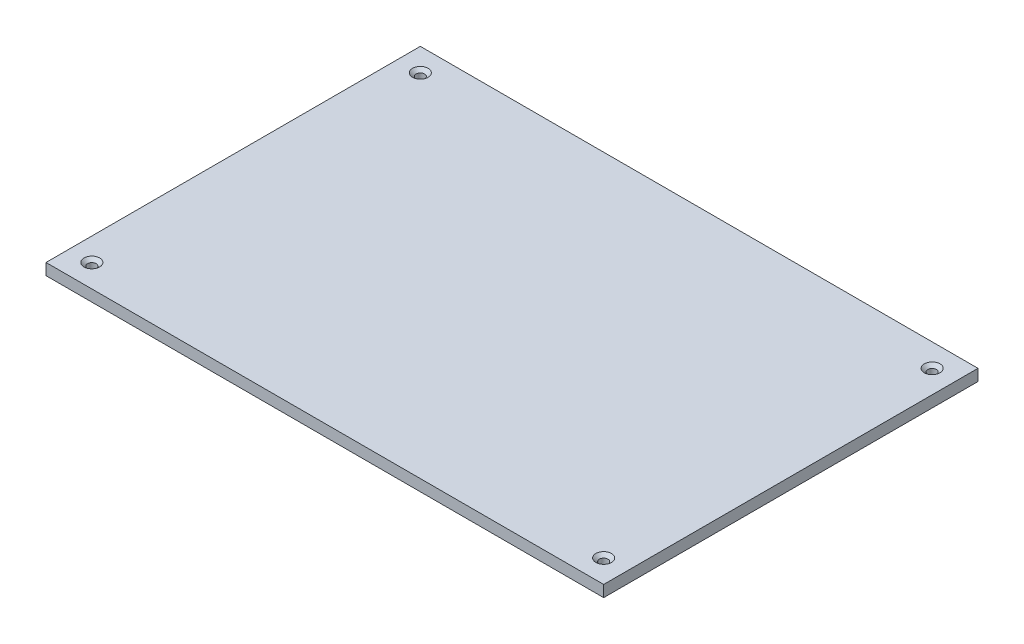
ISO-10303-21;
HEADER;
FILE_DESCRIPTION(('STEP AP214'),'2;1');
FILE_NAME('part.step','',(''),(''),'','','');
FILE_SCHEMA(('AUTOMOTIVE_DESIGN { 1 0 10303 214 1 1 1 1 }'));
ENDSEC;
DATA;
#1=APPLICATION_CONTEXT('core data for automotive mechanical design processes');
#2=APPLICATION_PROTOCOL_DEFINITION('international standard','automotive_design',2000,#1);
#3=PRODUCT_CONTEXT('',#1,'mechanical');
#4=PRODUCT('Part','Part','',(#3));
#5=PRODUCT_RELATED_PRODUCT_CATEGORY('part','',(#4));
#6=PRODUCT_DEFINITION_FORMATION('','',#4);
#7=PRODUCT_DEFINITION_CONTEXT('part definition',#1,'design');
#8=PRODUCT_DEFINITION('design','',#6,#7);
#9=PRODUCT_DEFINITION_SHAPE('','',#8);
#10=(LENGTH_UNIT() NAMED_UNIT(*) SI_UNIT(.MILLI.,.METRE.));
#11=(NAMED_UNIT(*) PLANE_ANGLE_UNIT() SI_UNIT($,.RADIAN.));
#12=(NAMED_UNIT(*) SI_UNIT($,.STERADIAN.) SOLID_ANGLE_UNIT());
#13=UNCERTAINTY_MEASURE_WITH_UNIT(LENGTH_MEASURE(1.E-05),#10,'distance_accuracy_value','');
#14=(GEOMETRIC_REPRESENTATION_CONTEXT(3) GLOBAL_UNCERTAINTY_ASSIGNED_CONTEXT((#13)) GLOBAL_UNIT_ASSIGNED_CONTEXT((#10,
#11,#12)) REPRESENTATION_CONTEXT('',''));
#15=CARTESIAN_POINT('',(0.,0.,0.));
#16=DIRECTION('',(0.,0.,1.));
#17=DIRECTION('',(1.,0.,0.));
#18=AXIS2_PLACEMENT_3D('',#15,#16,#17);
#19=CARTESIAN_POINT('',(0.,9.52500000000001,0.));
#20=DIRECTION('',(1.,0.,0.));
#21=DIRECTION('',(0.,0.,-1.));
#22=AXIS2_PLACEMENT_3D('',#19,#20,#21);
#23=PLANE('',#22);
#24=DIRECTION('',(0.,0.,1.));
#25=VECTOR('',#24,1.);
#26=CARTESIAN_POINT('',(0.,0.,0.));
#27=LINE('',#26,#25);
#28=CARTESIAN_POINT('',(0.,0.,0.));
#29=VERTEX_POINT('',#28);
#30=CARTESIAN_POINT('',(0.,0.,311.15));
#31=VERTEX_POINT('',#30);
#32=EDGE_CURVE('E142',#29,#31,#27,.T.);
#33=ORIENTED_EDGE('',*,*,#32,.T.);
#34=DIRECTION('',(0.,-1.,0.));
#35=VECTOR('',#34,1.);
#36=CARTESIAN_POINT('',(0.,9.52500000000001,311.15));
#37=LINE('',#36,#35);
#38=CARTESIAN_POINT('',(0.,9.52500000000001,311.15));
#39=VERTEX_POINT('',#38);
#40=EDGE_CURVE('E133',#39,#31,#37,.T.);
#41=ORIENTED_EDGE('',*,*,#40,.F.);
#42=DIRECTION('',(0.,0.,1.));
#43=VECTOR('',#42,1.);
#44=CARTESIAN_POINT('',(0.,9.52500000000001,0.));
#45=LINE('',#44,#43);
#46=CARTESIAN_POINT('',(0.,9.52500000000001,0.));
#47=VERTEX_POINT('',#46);
#48=EDGE_CURVE('E127',#47,#39,#45,.T.);
#49=ORIENTED_EDGE('',*,*,#48,.F.);
#50=DIRECTION('',(0.,-1.,0.));
#51=VECTOR('',#50,1.);
#52=CARTESIAN_POINT('',(0.,9.52500000000001,0.));
#53=LINE('',#52,#51);
#54=EDGE_CURVE('E138',#47,#29,#53,.T.);
#55=ORIENTED_EDGE('',*,*,#54,.T.);
#56=EDGE_LOOP('',(#33,#41,#49,#55));
#57=FACE_BOUND('',#56,.T.);
#58=ADVANCED_FACE('F74',(#57),#23,.F.);
#59=CARTESIAN_POINT('',(0.,9.52500000000001,311.15));
#60=DIRECTION('',(0.,0.,-1.));
#61=DIRECTION('',(-1.,0.,0.));
#62=AXIS2_PLACEMENT_3D('',#59,#60,#61);
#63=PLANE('',#62);
#64=DIRECTION('',(1.,0.,0.));
#65=VECTOR('',#64,1.);
#66=CARTESIAN_POINT('',(0.,0.,311.15));
#67=LINE('',#66,#65);
#68=CARTESIAN_POINT('',(463.55,0.,311.15));
#69=VERTEX_POINT('',#68);
#70=EDGE_CURVE('E132',#31,#69,#67,.T.);
#71=ORIENTED_EDGE('',*,*,#70,.T.);
#72=DIRECTION('',(0.,-1.,0.));
#73=VECTOR('',#72,1.);
#74=CARTESIAN_POINT('',(463.55,9.52500000000001,311.15));
#75=LINE('',#74,#73);
#76=CARTESIAN_POINT('',(463.55,9.52500000000001,311.15));
#77=VERTEX_POINT('',#76);
#78=EDGE_CURVE('E130',#77,#69,#75,.T.);
#79=ORIENTED_EDGE('',*,*,#78,.F.);
#80=DIRECTION('',(1.,0.,0.));
#81=VECTOR('',#80,1.);
#82=CARTESIAN_POINT('',(0.,9.52500000000001,311.15));
#83=LINE('',#82,#81);
#84=EDGE_CURVE('E122',#39,#77,#83,.T.);
#85=ORIENTED_EDGE('',*,*,#84,.F.);
#86=ORIENTED_EDGE('',*,*,#40,.T.);
#87=EDGE_LOOP('',(#71,#79,#85,#86));
#88=FACE_BOUND('',#87,.T.);
#89=ADVANCED_FACE('F131',(#88),#63,.F.);
#90=CARTESIAN_POINT('',(463.55,9.52500000000001,0.));
#91=DIRECTION('',(-1.,0.,0.));
#92=DIRECTION('',(0.,0.,1.));
#93=AXIS2_PLACEMENT_3D('',#90,#91,#92);
#94=PLANE('',#93);
#95=DIRECTION('',(0.,0.,-1.));
#96=VECTOR('',#95,1.);
#97=CARTESIAN_POINT('',(463.55,0.,0.));
#98=LINE('',#97,#96);
#99=CARTESIAN_POINT('',(463.55,0.,0.));
#100=VERTEX_POINT('',#99);
#101=EDGE_CURVE('E108',#69,#100,#98,.T.);
#102=ORIENTED_EDGE('',*,*,#101,.T.);
#103=DIRECTION('',(0.,-1.,0.));
#104=VECTOR('',#103,1.);
#105=CARTESIAN_POINT('',(463.55,9.52500000000001,0.));
#106=LINE('',#105,#104);
#107=CARTESIAN_POINT('',(463.55,9.52500000000001,0.));
#108=VERTEX_POINT('',#107);
#109=EDGE_CURVE('E134',#108,#100,#106,.T.);
#110=ORIENTED_EDGE('',*,*,#109,.F.);
#111=DIRECTION('',(0.,0.,-1.));
#112=VECTOR('',#111,1.);
#113=CARTESIAN_POINT('',(463.55,9.52500000000001,0.));
#114=LINE('',#113,#112);
#115=EDGE_CURVE('E125',#77,#108,#114,.T.);
#116=ORIENTED_EDGE('',*,*,#115,.F.);
#117=ORIENTED_EDGE('',*,*,#78,.T.);
#118=EDGE_LOOP('',(#102,#110,#116,#117));
#119=FACE_BOUND('',#118,.T.);
#120=ADVANCED_FACE('F136',(#119),#94,.F.);
#121=CARTESIAN_POINT('',(0.,9.52500000000001,0.));
#122=DIRECTION('',(0.,0.,1.));
#123=DIRECTION('',(1.,0.,0.));
#124=AXIS2_PLACEMENT_3D('',#121,#122,#123);
#125=PLANE('',#124);
#126=DIRECTION('',(-1.,0.,0.));
#127=VECTOR('',#126,1.);
#128=CARTESIAN_POINT('',(0.,0.,0.));
#129=LINE('',#128,#127);
#130=EDGE_CURVE('E114',#100,#29,#129,.T.);
#131=ORIENTED_EDGE('',*,*,#130,.T.);
#132=ORIENTED_EDGE('',*,*,#54,.F.);
#133=DIRECTION('',(-1.,0.,0.));
#134=VECTOR('',#133,1.);
#135=CARTESIAN_POINT('',(0.,9.52500000000001,0.));
#136=LINE('',#135,#134);
#137=EDGE_CURVE('E91',#108,#47,#136,.T.);
#138=ORIENTED_EDGE('',*,*,#137,.F.);
#139=ORIENTED_EDGE('',*,*,#109,.T.);
#140=EDGE_LOOP('',(#131,#132,#138,#139));
#141=FACE_BOUND('',#140,.T.);
#142=ADVANCED_FACE('F235',(#141),#125,.F.);
#143=CARTESIAN_POINT('',(0.,9.52500000000001,0.));
#144=DIRECTION('',(0.,1.,0.));
#145=DIRECTION('',(0.,0.,1.));
#146=AXIS2_PLACEMENT_3D('',#143,#144,#145);
#147=PLANE('',#146);
#148=CARTESIAN_POINT('',(444.5,9.52500000000001,292.1));
#149=DIRECTION('',(0.,1.,0.));
#150=DIRECTION('',(0.,0.,1.));
#151=AXIS2_PLACEMENT_3D('',#148,#149,#150);
#152=CIRCLE('',#151,6.49287500000018);
#153=CARTESIAN_POINT('',(444.5,9.52500000000001,298.592875));
#154=VERTEX_POINT('',#153);
#155=EDGE_CURVE('E164',#154,#154,#152,.F.);
#156=ORIENTED_EDGE('',*,*,#155,.T.);
#157=EDGE_LOOP('',(#156));
#158=FACE_BOUND('',#157,.T.);
#159=CARTESIAN_POINT('',(444.5,9.52500000000001,19.0499999999999));
#160=DIRECTION('',(0.,1.,0.));
#161=DIRECTION('',(0.,0.,1.));
#162=AXIS2_PLACEMENT_3D('',#159,#160,#161);
#163=CIRCLE('',#162,6.49287499999984);
#164=CARTESIAN_POINT('',(444.5,9.52500000000001,25.5428749999997));
#165=VERTEX_POINT('',#164);
#166=EDGE_CURVE('E161',#165,#165,#163,.F.);
#167=ORIENTED_EDGE('',*,*,#166,.T.);
#168=EDGE_LOOP('',(#167));
#169=FACE_BOUND('',#168,.T.);
#170=CARTESIAN_POINT('',(19.05,9.52500000000001,19.05));
#171=DIRECTION('',(0.,1.,0.));
#172=DIRECTION('',(0.,0.,1.));
#173=AXIS2_PLACEMENT_3D('',#170,#171,#172);
#174=CIRCLE('',#173,6.49287500000001);
#175=CARTESIAN_POINT('',(19.05,9.52500000000001,25.542875));
#176=VERTEX_POINT('',#175);
#177=EDGE_CURVE('E158',#176,#176,#174,.F.);
#178=ORIENTED_EDGE('',*,*,#177,.T.);
#179=EDGE_LOOP('',(#178));
#180=FACE_BOUND('',#179,.T.);
#181=CARTESIAN_POINT('',(19.0500000000001,9.52500000000001,292.1));
#182=DIRECTION('',(0.,1.,0.));
#183=DIRECTION('',(0.,0.,1.));
#184=AXIS2_PLACEMENT_3D('',#181,#182,#183);
#185=CIRCLE('',#184,6.49287500000001);
#186=CARTESIAN_POINT('',(19.0500000000001,9.52500000000001,298.592875));
#187=VERTEX_POINT('',#186);
#188=EDGE_CURVE('E155',#187,#187,#185,.F.);
#189=ORIENTED_EDGE('',*,*,#188,.T.);
#190=EDGE_LOOP('',(#189));
#191=FACE_BOUND('',#190,.T.);
#192=ORIENTED_EDGE('',*,*,#48,.T.);
#193=ORIENTED_EDGE('',*,*,#84,.T.);
#194=ORIENTED_EDGE('',*,*,#115,.T.);
#195=ORIENTED_EDGE('',*,*,#137,.T.);
#196=EDGE_LOOP('',(#192,#193,#194,#195));
#197=FACE_BOUND('',#196,.T.);
#198=ADVANCED_FACE('F123',(#158,#169,#180,#191,#197),#147,.T.);
#199=CARTESIAN_POINT('',(0.,0.,0.));
#200=DIRECTION('',(0.,1.,0.));
#201=DIRECTION('',(0.,0.,1.));
#202=AXIS2_PLACEMENT_3D('',#199,#200,#201);
#203=PLANE('',#202);
#204=CARTESIAN_POINT('',(19.05,0.,19.05));
#205=DIRECTION('',(0.,1.,0.));
#206=DIRECTION('',(0.,0.,1.));
#207=AXIS2_PLACEMENT_3D('',#204,#205,#206);
#208=CIRCLE('',#207,3.571875);
#209=CARTESIAN_POINT('',(19.05,0.,22.621875));
#210=VERTEX_POINT('',#209);
#211=EDGE_CURVE('E216',#210,#210,#208,.F.);
#212=ORIENTED_EDGE('',*,*,#211,.F.);
#213=EDGE_LOOP('',(#212));
#214=FACE_BOUND('',#213,.T.);
#215=CARTESIAN_POINT('',(444.5,0.,292.1));
#216=DIRECTION('',(0.,1.,0.));
#217=DIRECTION('',(0.,0.,1.));
#218=AXIS2_PLACEMENT_3D('',#215,#216,#217);
#219=CIRCLE('',#218,3.57187499999998);
#220=CARTESIAN_POINT('',(444.5,0.,295.671875));
#221=VERTEX_POINT('',#220);
#222=EDGE_CURVE('E214',#221,#221,#219,.F.);
#223=ORIENTED_EDGE('',*,*,#222,.F.);
#224=EDGE_LOOP('',(#223));
#225=FACE_BOUND('',#224,.T.);
#226=CARTESIAN_POINT('',(19.0500000000001,0.,292.1));
#227=DIRECTION('',(0.,1.,0.));
#228=DIRECTION('',(0.,0.,1.));
#229=AXIS2_PLACEMENT_3D('',#226,#227,#228);
#230=CIRCLE('',#229,3.57187499999999);
#231=CARTESIAN_POINT('',(19.0500000000001,0.,295.671875));
#232=VERTEX_POINT('',#231);
#233=EDGE_CURVE('E217',#232,#232,#230,.F.);
#234=ORIENTED_EDGE('',*,*,#233,.F.);
#235=EDGE_LOOP('',(#234));
#236=FACE_BOUND('',#235,.T.);
#237=CARTESIAN_POINT('',(444.5,0.,19.0499999999999));
#238=DIRECTION('',(0.,1.,0.));
#239=DIRECTION('',(0.,0.,1.));
#240=AXIS2_PLACEMENT_3D('',#237,#238,#239);
#241=CIRCLE('',#240,3.57187499999998);
#242=CARTESIAN_POINT('',(444.5,0.,22.6218749999999));
#243=VERTEX_POINT('',#242);
#244=EDGE_CURVE('E145',#243,#243,#241,.F.);
#245=ORIENTED_EDGE('',*,*,#244,.F.);
#246=EDGE_LOOP('',(#245));
#247=FACE_BOUND('',#246,.T.);
#248=ORIENTED_EDGE('',*,*,#32,.F.);
#249=ORIENTED_EDGE('',*,*,#130,.F.);
#250=ORIENTED_EDGE('',*,*,#101,.F.);
#251=ORIENTED_EDGE('',*,*,#70,.F.);
#252=EDGE_LOOP('',(#248,#249,#250,#251));
#253=FACE_BOUND('',#252,.T.);
#254=ADVANCED_FACE('F229',(#214,#225,#236,#247,#253),#203,.F.);
#255=CARTESIAN_POINT('',(444.5,-10.1027881362028,19.0499999999999));
#256=DIRECTION('',(0.,1.,0.));
#257=DIRECTION('',(0.,0.,1.));
#258=AXIS2_PLACEMENT_3D('',#255,#256,#257);
#259=CYLINDRICAL_SURFACE('',#258,3.57187499999998);
#260=CARTESIAN_POINT('',(444.5,6.89491978660611,19.0499999999999));
#261=DIRECTION('',(0.,1.,0.));
#262=DIRECTION('',(0.,0.,1.));
#263=AXIS2_PLACEMENT_3D('',#260,#261,#262);
#264=CIRCLE('',#263,3.57187499999998);
#265=CARTESIAN_POINT('',(444.5,6.89491978660611,22.6218749999999));
#266=VERTEX_POINT('',#265);
#267=EDGE_CURVE('E167',#266,#266,#264,.T.);
#268=ORIENTED_EDGE('',*,*,#267,.T.);
#269=EDGE_LOOP('',(#268));
#270=FACE_BOUND('',#269,.T.);
#271=ORIENTED_EDGE('',*,*,#244,.T.);
#272=EDGE_LOOP('',(#271));
#273=FACE_BOUND('',#272,.T.);
#274=ADVANCED_FACE('F227',(#270,#273),#259,.F.);
#275=CARTESIAN_POINT('',(19.0500000000001,-10.1027881362028,292.1));
#276=DIRECTION('',(0.,1.,0.));
#277=DIRECTION('',(0.,0.,1.));
#278=AXIS2_PLACEMENT_3D('',#275,#276,#277);
#279=CYLINDRICAL_SURFACE('',#278,3.57187499999999);
#280=CARTESIAN_POINT('',(19.0500000000001,6.89491978660606,292.1));
#281=DIRECTION('',(0.,1.,0.));
#282=DIRECTION('',(0.,0.,1.));
#283=AXIS2_PLACEMENT_3D('',#280,#281,#282);
#284=CIRCLE('',#283,3.57187499999999);
#285=CARTESIAN_POINT('',(19.0500000000001,6.89491978660606,295.671875));
#286=VERTEX_POINT('',#285);
#287=EDGE_CURVE('E12',#286,#286,#284,.T.);
#288=ORIENTED_EDGE('',*,*,#287,.T.);
#289=EDGE_LOOP('',(#288));
#290=FACE_BOUND('',#289,.T.);
#291=ORIENTED_EDGE('',*,*,#233,.T.);
#292=EDGE_LOOP('',(#291));
#293=FACE_BOUND('',#292,.T.);
#294=ADVANCED_FACE('F210',(#290,#293),#279,.F.);
#295=CARTESIAN_POINT('',(444.5,-10.1027881362028,292.1));
#296=DIRECTION('',(0.,1.,0.));
#297=DIRECTION('',(0.,0.,1.));
#298=AXIS2_PLACEMENT_3D('',#295,#296,#297);
#299=CYLINDRICAL_SURFACE('',#298,3.57187499999998);
#300=CARTESIAN_POINT('',(444.5,6.89491978660584,292.1));
#301=DIRECTION('',(0.,1.,0.));
#302=DIRECTION('',(0.,0.,1.));
#303=AXIS2_PLACEMENT_3D('',#300,#301,#302);
#304=CIRCLE('',#303,3.57187499999998);
#305=CARTESIAN_POINT('',(444.5,6.89491978660584,295.671875));
#306=VERTEX_POINT('',#305);
#307=EDGE_CURVE('E152',#306,#306,#304,.T.);
#308=ORIENTED_EDGE('',*,*,#307,.T.);
#309=EDGE_LOOP('',(#308));
#310=FACE_BOUND('',#309,.T.);
#311=ORIENTED_EDGE('',*,*,#222,.T.);
#312=EDGE_LOOP('',(#311));
#313=FACE_BOUND('',#312,.T.);
#314=ADVANCED_FACE('F202',(#310,#313),#299,.F.);
#315=CARTESIAN_POINT('',(19.05,-10.1027881362028,19.05));
#316=DIRECTION('',(0.,1.,0.));
#317=DIRECTION('',(0.,0.,1.));
#318=AXIS2_PLACEMENT_3D('',#315,#316,#317);
#319=CYLINDRICAL_SURFACE('',#318,3.571875);
#320=CARTESIAN_POINT('',(19.05,6.89491978660606,19.05));
#321=DIRECTION('',(0.,1.,0.));
#322=DIRECTION('',(0.,0.,1.));
#323=AXIS2_PLACEMENT_3D('',#320,#321,#322);
#324=CIRCLE('',#323,3.571875);
#325=CARTESIAN_POINT('',(19.05,6.89491978660606,22.621875));
#326=VERTEX_POINT('',#325);
#327=EDGE_CURVE('E83',#326,#326,#324,.T.);
#328=ORIENTED_EDGE('',*,*,#327,.T.);
#329=EDGE_LOOP('',(#328));
#330=FACE_BOUND('',#329,.T.);
#331=ORIENTED_EDGE('',*,*,#211,.T.);
#332=EDGE_LOOP('',(#331));
#333=FACE_BOUND('',#332,.T.);
#334=ADVANCED_FACE('F172',(#330,#333),#319,.F.);
#335=CARTESIAN_POINT('',(444.5,6.89491978660584,292.1));
#336=DIRECTION('',(0.,1.,0.));
#337=DIRECTION('',(0.,0.,1.));
#338=AXIS2_PLACEMENT_3D('',#335,#336,#337);
#339=CONICAL_SURFACE('',#338,3.57187499999998,0.837758040957282);
#340=ORIENTED_EDGE('',*,*,#155,.F.);
#341=EDGE_LOOP('',(#340));
#342=FACE_BOUND('',#341,.T.);
#343=ORIENTED_EDGE('',*,*,#307,.F.);
#344=EDGE_LOOP('',(#343));
#345=FACE_BOUND('',#344,.T.);
#346=ADVANCED_FACE('F184',(#342,#345),#339,.F.);
#347=CARTESIAN_POINT('',(444.5,6.89491978660611,19.0499999999999));
#348=DIRECTION('',(0.,1.,0.));
#349=DIRECTION('',(0.,0.,1.));
#350=AXIS2_PLACEMENT_3D('',#347,#348,#349);
#351=CONICAL_SURFACE('',#350,3.57187499999998,0.837758040957278);
#352=ORIENTED_EDGE('',*,*,#166,.F.);
#353=EDGE_LOOP('',(#352));
#354=FACE_BOUND('',#353,.T.);
#355=ORIENTED_EDGE('',*,*,#267,.F.);
#356=EDGE_LOOP('',(#355));
#357=FACE_BOUND('',#356,.T.);
#358=ADVANCED_FACE('F177',(#354,#357),#351,.F.);
#359=CARTESIAN_POINT('',(19.05,6.89491978660606,19.05));
#360=DIRECTION('',(0.,1.,0.));
#361=DIRECTION('',(0.,0.,1.));
#362=AXIS2_PLACEMENT_3D('',#359,#360,#361);
#363=CONICAL_SURFACE('',#362,3.571875,0.837758040957285);
#364=ORIENTED_EDGE('',*,*,#177,.F.);
#365=EDGE_LOOP('',(#364));
#366=FACE_BOUND('',#365,.T.);
#367=ORIENTED_EDGE('',*,*,#327,.F.);
#368=EDGE_LOOP('',(#367));
#369=FACE_BOUND('',#368,.T.);
#370=ADVANCED_FACE('F175',(#366,#369),#363,.F.);
#371=CARTESIAN_POINT('',(19.0500000000001,6.89491978660606,292.1));
#372=DIRECTION('',(0.,1.,0.));
#373=DIRECTION('',(0.,0.,1.));
#374=AXIS2_PLACEMENT_3D('',#371,#372,#373);
#375=CONICAL_SURFACE('',#374,3.57187499999999,0.837758040957285);
#376=ORIENTED_EDGE('',*,*,#188,.F.);
#377=EDGE_LOOP('',(#376));
#378=FACE_BOUND('',#377,.T.);
#379=ORIENTED_EDGE('',*,*,#287,.F.);
#380=EDGE_LOOP('',(#379));
#381=FACE_BOUND('',#380,.T.);
#382=ADVANCED_FACE('F76',(#378,#381),#375,.F.);
#383=CLOSED_SHELL('',(#58,#89,#120,#142,#198,#254,#274,#294,#314,#334,#346,#358,#370,#382));
#384=MANIFOLD_SOLID_BREP('B2',#383);
#385=ADVANCED_BREP_SHAPE_REPRESENTATION('',(#18,#384),#14);
#386=SHAPE_DEFINITION_REPRESENTATION(#9,#385);
ENDSEC;
END-ISO-10303-21;
